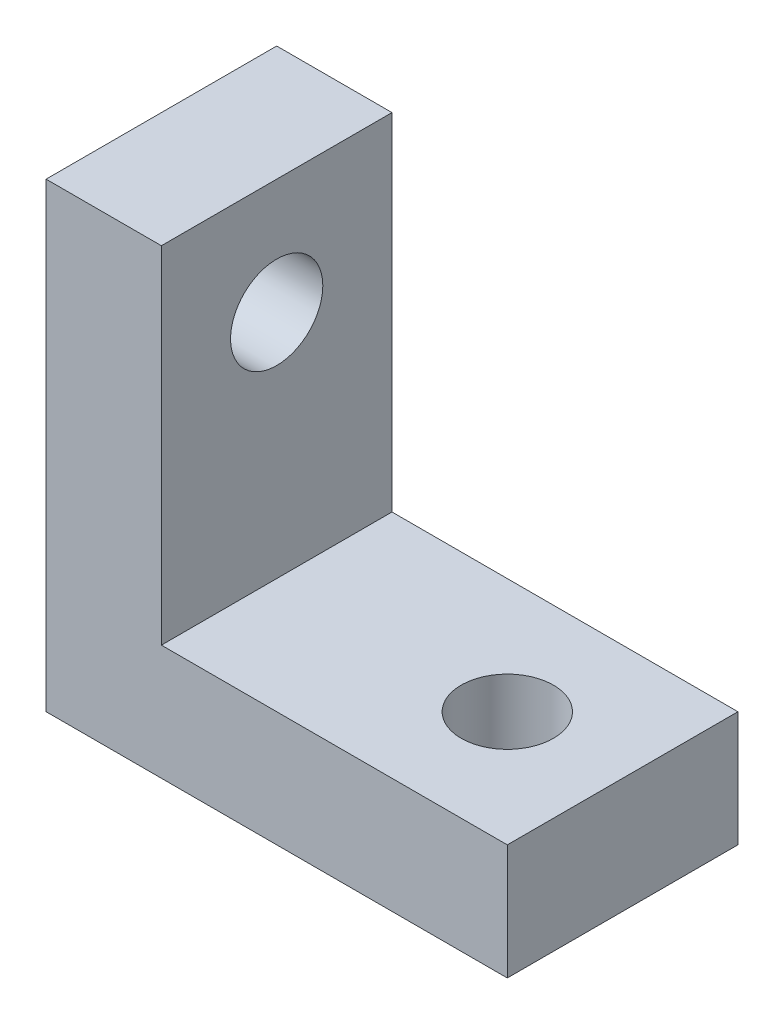
ISO-10303-21;
HEADER;
FILE_DESCRIPTION(('STEP AP214'),'2;1');
FILE_NAME('part.step','',(''),(''),'','','');
FILE_SCHEMA(('AUTOMOTIVE_DESIGN { 1 0 10303 214 1 1 1 1 }'));
ENDSEC;
DATA;
#1=APPLICATION_CONTEXT('core data for automotive mechanical design processes');
#2=APPLICATION_PROTOCOL_DEFINITION('international standard','automotive_design',2000,#1);
#3=PRODUCT_CONTEXT('',#1,'mechanical');
#4=PRODUCT('Part','Part','',(#3));
#5=PRODUCT_RELATED_PRODUCT_CATEGORY('part','',(#4));
#6=PRODUCT_DEFINITION_FORMATION('','',#4);
#7=PRODUCT_DEFINITION_CONTEXT('part definition',#1,'design');
#8=PRODUCT_DEFINITION('design','',#6,#7);
#9=PRODUCT_DEFINITION_SHAPE('','',#8);
#10=(LENGTH_UNIT() NAMED_UNIT(*) SI_UNIT(.MILLI.,.METRE.));
#11=(NAMED_UNIT(*) PLANE_ANGLE_UNIT() SI_UNIT($,.RADIAN.));
#12=(NAMED_UNIT(*) SI_UNIT($,.STERADIAN.) SOLID_ANGLE_UNIT());
#13=UNCERTAINTY_MEASURE_WITH_UNIT(LENGTH_MEASURE(1.E-05),#10,'distance_accuracy_value','');
#14=(GEOMETRIC_REPRESENTATION_CONTEXT(3) GLOBAL_UNCERTAINTY_ASSIGNED_CONTEXT((#13)) GLOBAL_UNIT_ASSIGNED_CONTEXT((#10,
#11,#12)) REPRESENTATION_CONTEXT('',''));
#15=CARTESIAN_POINT('',(0.,0.,0.));
#16=DIRECTION('',(0.,0.,1.));
#17=DIRECTION('',(1.,0.,0.));
#18=AXIS2_PLACEMENT_3D('',#15,#16,#17);
#19=CARTESIAN_POINT('',(-9.84057231720679,-20.0817860089826,10.));
#20=DIRECTION('',(-1.,0.,0.));
#21=DIRECTION('',(0.,0.,1.));
#22=AXIS2_PLACEMENT_3D('',#19,#20,#21);
#23=PLANE('',#22);
#24=CARTESIAN_POINT('',(-9.84057231720679,15.,5.));
#25=DIRECTION('',(1.,0.,0.));
#26=DIRECTION('',(0.,0.,-1.));
#27=AXIS2_PLACEMENT_3D('',#24,#25,#26);
#28=CIRCLE('',#27,2.);
#29=CARTESIAN_POINT('',(-9.84057231720679,15.,3.));
#30=VERTEX_POINT('',#29);
#31=EDGE_CURVE('E151',#30,#30,#28,.T.);
#32=ORIENTED_EDGE('',*,*,#31,.T.);
#33=EDGE_LOOP('',(#32));
#34=FACE_BOUND('',#33,.T.);
#35=DIRECTION('',(0.,1.,0.));
#36=VECTOR('',#35,1.);
#37=CARTESIAN_POINT('',(-9.84057231720679,-20.0817860089826,0.));
#38=LINE('',#37,#36);
#39=CARTESIAN_POINT('',(-9.84057231720679,0.,0.));
#40=VERTEX_POINT('',#39);
#41=CARTESIAN_POINT('',(-9.84057231720679,20.,0.));
#42=VERTEX_POINT('',#41);
#43=EDGE_CURVE('E117',#40,#42,#38,.T.);
#44=ORIENTED_EDGE('',*,*,#43,.F.);
#45=DIRECTION('',(0.,0.,-1.));
#46=VECTOR('',#45,1.);
#47=CARTESIAN_POINT('',(-9.84057231720679,0.,10.));
#48=LINE('',#47,#46);
#49=CARTESIAN_POINT('',(-9.84057231720679,0.,10.));
#50=VERTEX_POINT('',#49);
#51=EDGE_CURVE('E11',#50,#40,#48,.T.);
#52=ORIENTED_EDGE('',*,*,#51,.F.);
#53=DIRECTION('',(0.,1.,0.));
#54=VECTOR('',#53,1.);
#55=CARTESIAN_POINT('',(-9.84057231720679,-20.0817860089826,10.));
#56=LINE('',#55,#54);
#57=CARTESIAN_POINT('',(-9.84057231720679,20.,10.));
#58=VERTEX_POINT('',#57);
#59=EDGE_CURVE('E131',#50,#58,#56,.T.);
#60=ORIENTED_EDGE('',*,*,#59,.T.);
#61=DIRECTION('',(0.,0.,-1.));
#62=VECTOR('',#61,1.);
#63=CARTESIAN_POINT('',(-9.84057231720679,20.,10.));
#64=LINE('',#63,#62);
#65=EDGE_CURVE('E79',#58,#42,#64,.T.);
#66=ORIENTED_EDGE('',*,*,#65,.T.);
#67=EDGE_LOOP('',(#44,#52,#60,#66));
#68=FACE_BOUND('',#67,.T.);
#69=ADVANCED_FACE('F35',(#34,#68),#23,.T.);
#70=CARTESIAN_POINT('',(-2.84042023662463,0.,10.));
#71=DIRECTION('',(0.,1.,0.));
#72=DIRECTION('',(0.,0.,1.));
#73=AXIS2_PLACEMENT_3D('',#70,#71,#72);
#74=PLANE('',#73);
#75=CARTESIAN_POINT('',(5.15942768279321,0.,5.));
#76=DIRECTION('',(0.,1.,0.));
#77=DIRECTION('',(0.,0.,1.));
#78=AXIS2_PLACEMENT_3D('',#75,#76,#77);
#79=CIRCLE('',#78,2.);
#80=CARTESIAN_POINT('',(5.15942768279321,0.,7.));
#81=VERTEX_POINT('',#80);
#82=EDGE_CURVE('E121',#81,#81,#79,.T.);
#83=ORIENTED_EDGE('',*,*,#82,.T.);
#84=EDGE_LOOP('',(#83));
#85=FACE_BOUND('',#84,.T.);
#86=DIRECTION('',(1.,0.,0.));
#87=VECTOR('',#86,1.);
#88=CARTESIAN_POINT('',(-2.84042023662463,0.,0.));
#89=LINE('',#88,#87);
#90=CARTESIAN_POINT('',(10.1594276827932,0.,0.));
#91=VERTEX_POINT('',#90);
#92=EDGE_CURVE('E120',#40,#91,#89,.T.);
#93=ORIENTED_EDGE('',*,*,#92,.T.);
#94=DIRECTION('',(0.,0.,-1.));
#95=VECTOR('',#94,1.);
#96=CARTESIAN_POINT('',(10.1594276827932,0.,10.));
#97=LINE('',#96,#95);
#98=CARTESIAN_POINT('',(10.1594276827932,0.,10.));
#99=VERTEX_POINT('',#98);
#100=EDGE_CURVE('E43',#99,#91,#97,.T.);
#101=ORIENTED_EDGE('',*,*,#100,.F.);
#102=DIRECTION('',(1.,0.,0.));
#103=VECTOR('',#102,1.);
#104=CARTESIAN_POINT('',(-2.84042023662463,0.,10.));
#105=LINE('',#104,#103);
#106=EDGE_CURVE('E112',#50,#99,#105,.T.);
#107=ORIENTED_EDGE('',*,*,#106,.F.);
#108=ORIENTED_EDGE('',*,*,#51,.T.);
#109=EDGE_LOOP('',(#93,#101,#107,#108));
#110=FACE_BOUND('',#109,.T.);
#111=ADVANCED_FACE('F140',(#85,#110),#74,.F.);
#112=CARTESIAN_POINT('',(10.1594276827932,-20.0817860089826,10.));
#113=DIRECTION('',(1.,0.,0.));
#114=DIRECTION('',(0.,1.,0.));
#115=AXIS2_PLACEMENT_3D('',#112,#113,#114);
#116=PLANE('',#115);
#117=DIRECTION('',(0.,-1.,0.));
#118=VECTOR('',#117,1.);
#119=CARTESIAN_POINT('',(10.1594276827932,-20.0817860089826,0.));
#120=LINE('',#119,#118);
#121=CARTESIAN_POINT('',(10.1594276827932,5.,0.));
#122=VERTEX_POINT('',#121);
#123=EDGE_CURVE('E124',#122,#91,#120,.T.);
#124=ORIENTED_EDGE('',*,*,#123,.F.);
#125=DIRECTION('',(0.,0.,-1.));
#126=VECTOR('',#125,1.);
#127=CARTESIAN_POINT('',(10.1594276827932,5.,10.));
#128=LINE('',#127,#126);
#129=CARTESIAN_POINT('',(10.1594276827932,5.,10.));
#130=VERTEX_POINT('',#129);
#131=EDGE_CURVE('E101',#130,#122,#128,.T.);
#132=ORIENTED_EDGE('',*,*,#131,.F.);
#133=DIRECTION('',(0.,-1.,0.));
#134=VECTOR('',#133,1.);
#135=CARTESIAN_POINT('',(10.1594276827932,-20.0817860089826,10.));
#136=LINE('',#135,#134);
#137=EDGE_CURVE('E110',#130,#99,#136,.T.);
#138=ORIENTED_EDGE('',*,*,#137,.T.);
#139=ORIENTED_EDGE('',*,*,#100,.T.);
#140=EDGE_LOOP('',(#124,#132,#138,#139));
#141=FACE_BOUND('',#140,.T.);
#142=ADVANCED_FACE('F137',(#141),#116,.T.);
#143=CARTESIAN_POINT('',(-2.84042023662463,5.,10.));
#144=DIRECTION('',(0.,1.,0.));
#145=DIRECTION('',(0.,0.,1.));
#146=AXIS2_PLACEMENT_3D('',#143,#144,#145);
#147=PLANE('',#146);
#148=CARTESIAN_POINT('',(5.15942768279321,5.,5.));
#149=DIRECTION('',(0.,1.,0.));
#150=DIRECTION('',(0.,0.,1.));
#151=AXIS2_PLACEMENT_3D('',#148,#149,#150);
#152=CIRCLE('',#151,2.);
#153=CARTESIAN_POINT('',(5.15942768279321,5.,7.));
#154=VERTEX_POINT('',#153);
#155=EDGE_CURVE('E148',#154,#154,#152,.T.);
#156=ORIENTED_EDGE('',*,*,#155,.F.);
#157=EDGE_LOOP('',(#156));
#158=FACE_BOUND('',#157,.T.);
#159=DIRECTION('',(1.,0.,0.));
#160=VECTOR('',#159,1.);
#161=CARTESIAN_POINT('',(-2.84042023662463,5.,0.));
#162=LINE('',#161,#160);
#163=CARTESIAN_POINT('',(-4.84057231720679,5.,0.));
#164=VERTEX_POINT('',#163);
#165=EDGE_CURVE('E100',#164,#122,#162,.T.);
#166=ORIENTED_EDGE('',*,*,#165,.F.);
#167=DIRECTION('',(0.,0.,-1.));
#168=VECTOR('',#167,1.);
#169=CARTESIAN_POINT('',(-4.84057231720679,5.,10.));
#170=LINE('',#169,#168);
#171=CARTESIAN_POINT('',(-4.84057231720679,5.,10.));
#172=VERTEX_POINT('',#171);
#173=EDGE_CURVE('E94',#172,#164,#170,.T.);
#174=ORIENTED_EDGE('',*,*,#173,.F.);
#175=DIRECTION('',(1.,0.,0.));
#176=VECTOR('',#175,1.);
#177=CARTESIAN_POINT('',(-2.84042023662463,5.,10.));
#178=LINE('',#177,#176);
#179=EDGE_CURVE('E98',#172,#130,#178,.T.);
#180=ORIENTED_EDGE('',*,*,#179,.T.);
#181=ORIENTED_EDGE('',*,*,#131,.T.);
#182=EDGE_LOOP('',(#166,#174,#180,#181));
#183=FACE_BOUND('',#182,.T.);
#184=ADVANCED_FACE('F96',(#158,#183),#147,.T.);
#185=CARTESIAN_POINT('',(-4.84057231720679,-20.0817860089826,10.));
#186=DIRECTION('',(-1.,0.,0.));
#187=DIRECTION('',(0.,0.,1.));
#188=AXIS2_PLACEMENT_3D('',#185,#186,#187);
#189=PLANE('',#188);
#190=CARTESIAN_POINT('',(-4.84057231720679,15.,5.));
#191=DIRECTION('',(1.,0.,0.));
#192=DIRECTION('',(0.,0.,-1.));
#193=AXIS2_PLACEMENT_3D('',#190,#191,#192);
#194=CIRCLE('',#193,2.);
#195=CARTESIAN_POINT('',(-4.84057231720679,15.,3.));
#196=VERTEX_POINT('',#195);
#197=EDGE_CURVE('E154',#196,#196,#194,.T.);
#198=ORIENTED_EDGE('',*,*,#197,.F.);
#199=EDGE_LOOP('',(#198));
#200=FACE_BOUND('',#199,.T.);
#201=DIRECTION('',(0.,1.,0.));
#202=VECTOR('',#201,1.);
#203=CARTESIAN_POINT('',(-4.84057231720679,-20.0817860089826,0.));
#204=LINE('',#203,#202);
#205=CARTESIAN_POINT('',(-4.84057231720679,20.,0.));
#206=VERTEX_POINT('',#205);
#207=EDGE_CURVE('E72',#164,#206,#204,.T.);
#208=ORIENTED_EDGE('',*,*,#207,.T.);
#209=DIRECTION('',(0.,0.,-1.));
#210=VECTOR('',#209,1.);
#211=CARTESIAN_POINT('',(-4.84057231720679,20.,10.));
#212=LINE('',#211,#210);
#213=CARTESIAN_POINT('',(-4.84057231720679,20.,10.));
#214=VERTEX_POINT('',#213);
#215=EDGE_CURVE('E102',#214,#206,#212,.T.);
#216=ORIENTED_EDGE('',*,*,#215,.F.);
#217=DIRECTION('',(0.,1.,0.));
#218=VECTOR('',#217,1.);
#219=CARTESIAN_POINT('',(-4.84057231720679,-20.0817860089826,10.));
#220=LINE('',#219,#218);
#221=EDGE_CURVE('E104',#172,#214,#220,.T.);
#222=ORIENTED_EDGE('',*,*,#221,.F.);
#223=ORIENTED_EDGE('',*,*,#173,.T.);
#224=EDGE_LOOP('',(#208,#216,#222,#223));
#225=FACE_BOUND('',#224,.T.);
#226=ADVANCED_FACE('F105',(#200,#225),#189,.F.);
#227=CARTESIAN_POINT('',(-2.84042023662463,20.,10.));
#228=DIRECTION('',(0.,-1.,0.));
#229=DIRECTION('',(0.,0.,-1.));
#230=AXIS2_PLACEMENT_3D('',#227,#228,#229);
#231=PLANE('',#230);
#232=DIRECTION('',(-1.,0.,0.));
#233=VECTOR('',#232,1.);
#234=CARTESIAN_POINT('',(-2.84042023662463,20.,0.));
#235=LINE('',#234,#233);
#236=EDGE_CURVE('E129',#206,#42,#235,.T.);
#237=ORIENTED_EDGE('',*,*,#236,.T.);
#238=ORIENTED_EDGE('',*,*,#65,.F.);
#239=DIRECTION('',(-1.,0.,0.));
#240=VECTOR('',#239,1.);
#241=CARTESIAN_POINT('',(-2.84042023662463,20.,10.));
#242=LINE('',#241,#240);
#243=EDGE_CURVE('E51',#214,#58,#242,.T.);
#244=ORIENTED_EDGE('',*,*,#243,.F.);
#245=ORIENTED_EDGE('',*,*,#215,.T.);
#246=EDGE_LOOP('',(#237,#238,#244,#245));
#247=FACE_BOUND('',#246,.T.);
#248=ADVANCED_FACE('F145',(#247),#231,.F.);
#249=CARTESIAN_POINT('',(-2.84042023662463,-20.0817860089826,10.));
#250=DIRECTION('',(0.,0.,1.));
#251=DIRECTION('',(1.,0.,0.));
#252=AXIS2_PLACEMENT_3D('',#249,#250,#251);
#253=PLANE('',#252);
#254=ORIENTED_EDGE('',*,*,#59,.F.);
#255=ORIENTED_EDGE('',*,*,#106,.T.);
#256=ORIENTED_EDGE('',*,*,#137,.F.);
#257=ORIENTED_EDGE('',*,*,#179,.F.);
#258=ORIENTED_EDGE('',*,*,#221,.T.);
#259=ORIENTED_EDGE('',*,*,#243,.T.);
#260=EDGE_LOOP('',(#254,#255,#256,#257,#258,#259));
#261=FACE_BOUND('',#260,.T.);
#262=ADVANCED_FACE('F108',(#261),#253,.T.);
#263=CARTESIAN_POINT('',(-2.84042023662463,-20.0817860089826,0.));
#264=DIRECTION('',(0.,0.,1.));
#265=DIRECTION('',(1.,0.,0.));
#266=AXIS2_PLACEMENT_3D('',#263,#264,#265);
#267=PLANE('',#266);
#268=ORIENTED_EDGE('',*,*,#43,.T.);
#269=ORIENTED_EDGE('',*,*,#236,.F.);
#270=ORIENTED_EDGE('',*,*,#207,.F.);
#271=ORIENTED_EDGE('',*,*,#165,.T.);
#272=ORIENTED_EDGE('',*,*,#123,.T.);
#273=ORIENTED_EDGE('',*,*,#92,.F.);
#274=EDGE_LOOP('',(#268,#269,#270,#271,#272,#273));
#275=FACE_BOUND('',#274,.T.);
#276=ADVANCED_FACE('F142',(#275),#267,.F.);
#277=CARTESIAN_POINT('',(5.15942768279321,0.,5.));
#278=DIRECTION('',(0.,1.,0.));
#279=DIRECTION('',(0.,0.,1.));
#280=AXIS2_PLACEMENT_3D('',#277,#278,#279);
#281=CYLINDRICAL_SURFACE('',#280,2.);
#282=ORIENTED_EDGE('',*,*,#82,.F.);
#283=EDGE_LOOP('',(#282));
#284=FACE_BOUND('',#283,.T.);
#285=ORIENTED_EDGE('',*,*,#155,.T.);
#286=EDGE_LOOP('',(#285));
#287=FACE_BOUND('',#286,.T.);
#288=ADVANCED_FACE('F164',(#284,#287),#281,.F.);
#289=CARTESIAN_POINT('',(-9.84057231720679,15.,5.));
#290=DIRECTION('',(1.,0.,0.));
#291=DIRECTION('',(0.,0.,-1.));
#292=AXIS2_PLACEMENT_3D('',#289,#290,#291);
#293=CYLINDRICAL_SURFACE('',#292,2.);
#294=ORIENTED_EDGE('',*,*,#31,.F.);
#295=EDGE_LOOP('',(#294));
#296=FACE_BOUND('',#295,.T.);
#297=ORIENTED_EDGE('',*,*,#197,.T.);
#298=EDGE_LOOP('',(#297));
#299=FACE_BOUND('',#298,.T.);
#300=ADVANCED_FACE('F161',(#296,#299),#293,.F.);
#301=CLOSED_SHELL('',(#69,#111,#142,#184,#226,#248,#262,#276,#288,#300));
#302=MANIFOLD_SOLID_BREP('B2',#301);
#303=ADVANCED_BREP_SHAPE_REPRESENTATION('',(#18,#302),#14);
#304=SHAPE_DEFINITION_REPRESENTATION(#9,#303);
ENDSEC;
END-ISO-10303-21;
